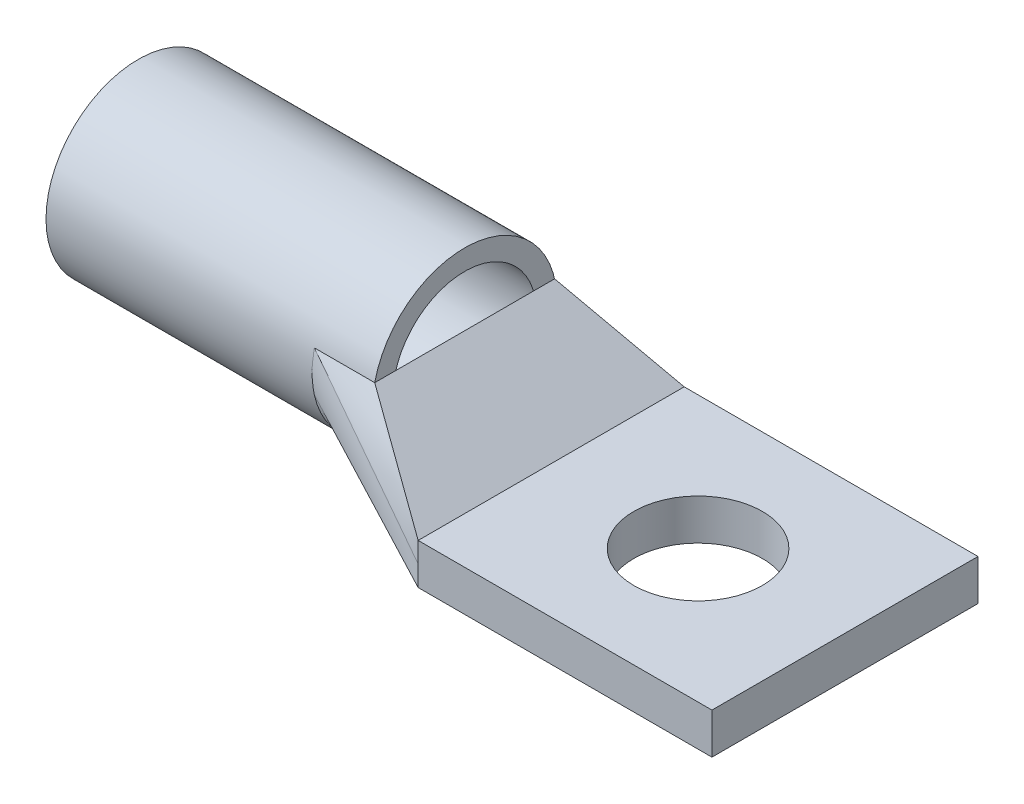
ISO-10303-21;
HEADER;
FILE_DESCRIPTION(('STEP AP214'),'2;1');
FILE_NAME('part.step','',(''),(''),'','','');
FILE_SCHEMA(('AUTOMOTIVE_DESIGN { 1 0 10303 214 1 1 1 1 }'));
ENDSEC;
DATA;
#1=APPLICATION_CONTEXT('core data for automotive mechanical design processes');
#2=APPLICATION_PROTOCOL_DEFINITION('international standard','automotive_design',2000,#1);
#3=PRODUCT_CONTEXT('',#1,'mechanical');
#4=PRODUCT('Part','Part','',(#3));
#5=PRODUCT_RELATED_PRODUCT_CATEGORY('part','',(#4));
#6=PRODUCT_DEFINITION_FORMATION('','',#4);
#7=PRODUCT_DEFINITION_CONTEXT('part definition',#1,'design');
#8=PRODUCT_DEFINITION('design','',#6,#7);
#9=PRODUCT_DEFINITION_SHAPE('','',#8);
#10=(LENGTH_UNIT() NAMED_UNIT(*) SI_UNIT(.MILLI.,.METRE.));
#11=(NAMED_UNIT(*) PLANE_ANGLE_UNIT() SI_UNIT($,.RADIAN.));
#12=(NAMED_UNIT(*) SI_UNIT($,.STERADIAN.) SOLID_ANGLE_UNIT());
#13=UNCERTAINTY_MEASURE_WITH_UNIT(LENGTH_MEASURE(1.E-05),#10,'distance_accuracy_value','');
#14=(GEOMETRIC_REPRESENTATION_CONTEXT(3) GLOBAL_UNCERTAINTY_ASSIGNED_CONTEXT((#13)) GLOBAL_UNIT_ASSIGNED_CONTEXT((#10,
#11,#12)) REPRESENTATION_CONTEXT('',''));
#15=CARTESIAN_POINT('',(0.,0.,0.));
#16=DIRECTION('',(0.,0.,1.));
#17=DIRECTION('',(1.,0.,0.));
#18=AXIS2_PLACEMENT_3D('',#15,#16,#17);
#19=CARTESIAN_POINT('',(-22.86,8.763,-6.9976884754896));
#20=CARTESIAN_POINT('',(-11.43,1.5875,-10.3505));
#21=CARTESIAN_POINT('',(-22.0768333333333,8.763,-6.9976884754896));
#22=CARTESIAN_POINT('',(-11.43,1.85208333333333,-10.3505));
#23=CARTESIAN_POINT('',(-21.2936666666666,8.763,-6.9976884754896));
#24=CARTESIAN_POINT('',(-11.43,2.11666666666666,-10.3505));
#25=CARTESIAN_POINT('',(-19.7273333333333,8.763,-6.9976884754896));
#26=CARTESIAN_POINT('',(-11.43,2.64583333333333,-10.3505));
#27=CARTESIAN_POINT('',(-18.9441666666666,8.763,-6.9976884754896));
#28=CARTESIAN_POINT('',(-11.43,2.91041666666667,-10.3505));
#29=CARTESIAN_POINT('',(-18.161,8.763,-6.9976884754896));
#30=CARTESIAN_POINT('',(-11.43,3.175,-10.3505));
#31=B_SPLINE_SURFACE_WITH_KNOTS('',3,1,((#19,#20),(#21,#22),(#23,#24),(#25,#26),(#27,#28),(#29,
#30)),.UNSPECIFIED.,.F.,.F.,.F.,(4,2,4),(2,2),(0.,0.5,1.),(0.,1.),.UNSPECIFIED.);
#32=DIRECTION('',(1.,0.,0.));
#33=VECTOR('',#32,1.);
#34=CARTESIAN_POINT('',(-20.5105,8.763,-6.9976884754896));
#35=LINE('',#34,#33);
#36=CARTESIAN_POINT('',(-22.86,8.763,-6.9976884754896));
#37=VERTEX_POINT('',#36);
#38=CARTESIAN_POINT('',(-18.161,8.763,-6.9976884754896));
#39=VERTEX_POINT('',#38);
#40=EDGE_CURVE('E107',#37,#39,#35,.T.);
#41=DIRECTION('',(0.718452409758832,-0.596451057158276,-0.357871864396327));
#42=VECTOR('',#41,1.);
#43=CARTESIAN_POINT('',(-14.7955,5.969,-8.6740942377448));
#44=LINE('',#43,#42);
#45=CARTESIAN_POINT('',(-11.43,3.175,-10.3505));
#46=VERTEX_POINT('',#45);
#47=EDGE_CURVE('E110',#39,#46,#44,.T.);
#48=DIRECTION('',(0.,-1.,0.));
#49=VECTOR('',#48,1.);
#50=CARTESIAN_POINT('',(-11.43,2.38125,-10.3505));
#51=LINE('',#50,#49);
#52=CARTESIAN_POINT('',(-11.43,1.5875,-10.3505));
#53=VERTEX_POINT('',#52);
#54=EDGE_CURVE('E126',#46,#53,#51,.T.);
#55=DIRECTION('',(-0.821953291698036,0.516004010899323,0.241107127647807));
#56=VECTOR('',#55,1.);
#57=CARTESIAN_POINT('',(-17.145,5.17525,-8.6740942377448));
#58=LINE('',#57,#56);
#59=EDGE_CURVE('E111',#53,#37,#58,.T.);
#60=ORIENTED_EDGE('',*,*,#40,.T.);
#61=ORIENTED_EDGE('',*,*,#47,.T.);
#62=ORIENTED_EDGE('',*,*,#54,.T.);
#63=ORIENTED_EDGE('',*,*,#59,.T.);
#64=EDGE_LOOP('',(#60,#61,#62,#63));
#65=FACE_BOUND('',#64,.T.);
#66=ADVANCED_FACE('F49',(#65),#31,.T.);
#67=CARTESIAN_POINT('',(-3.10313593256059,-3.73786828240253,0.));
#68=DIRECTION('',(0.638755375653495,0.769409884309892,0.));
#69=DIRECTION('',(-0.769409884309892,0.638755375653495,0.));
#70=AXIS2_PLACEMENT_3D('',#67,#68,#69);
#71=PLANE('',#70);
#72=DIRECTION('',(0.718452409758832,-0.596451057158275,0.357871864396328));
#73=VECTOR('',#72,1.);
#74=CARTESIAN_POINT('',(-18.161,8.76299999999999,6.9976884754896));
#75=LINE('',#74,#73);
#76=CARTESIAN_POINT('',(-18.161,8.76299999999999,6.9976884754896));
#77=VERTEX_POINT('',#76);
#78=CARTESIAN_POINT('',(-11.43,3.175,10.3505));
#79=VERTEX_POINT('',#78);
#80=EDGE_CURVE('E114',#77,#79,#75,.T.);
#81=ORIENTED_EDGE('',*,*,#80,.T.);
#82=DIRECTION('',(0.,0.,-1.));
#83=VECTOR('',#82,1.);
#84=CARTESIAN_POINT('',(-11.43,3.175,10.3505));
#85=LINE('',#84,#83);
#86=EDGE_CURVE('E121',#79,#46,#85,.T.);
#87=ORIENTED_EDGE('',*,*,#86,.T.);
#88=ORIENTED_EDGE('',*,*,#47,.F.);
#89=DIRECTION('',(0.,0.,-1.));
#90=VECTOR('',#89,1.);
#91=CARTESIAN_POINT('',(-18.161,8.76299999999999,6.9976884754896));
#92=LINE('',#91,#90);
#93=EDGE_CURVE('E116',#77,#39,#92,.T.);
#94=ORIENTED_EDGE('',*,*,#93,.F.);
#95=EDGE_LOOP('',(#81,#87,#88,#94));
#96=FACE_BOUND('',#95,.T.);
#97=ADVANCED_FACE('F123',(#96),#71,.T.);
#98=CARTESIAN_POINT('',(-22.86,5.588,-6.9976884754896));
#99=CARTESIAN_POINT('',(-11.43,0.,-10.3505));
#100=CARTESIAN_POINT('',(-22.86,6.10405372238124,-7.11476074687603));
#101=CARTESIAN_POINT('',(-11.43,0.264583333333334,-10.3505));
#102=CARTESIAN_POINT('',(-22.86,6.639694606142,-7.1755));
#103=CARTESIAN_POINT('',(-11.43,0.529166666666668,-10.3505));
#104=CARTESIAN_POINT('',(-22.86,7.71130539385799,-7.1755));
#105=CARTESIAN_POINT('',(-11.43,1.05833333333333,-10.3505));
#106=CARTESIAN_POINT('',(-22.86,8.24694627761876,-7.11476074687604));
#107=CARTESIAN_POINT('',(-11.43,1.32291666666667,-10.3505));
#108=CARTESIAN_POINT('',(-22.86,8.763,-6.9976884754896));
#109=CARTESIAN_POINT('',(-11.43,1.5875,-10.3505));
#110=B_SPLINE_SURFACE_WITH_KNOTS('',3,1,((#98,#99),(#100,#101),(#102,#103),(#104,#105),(#106,
#107),(#108,#109)),.UNSPECIFIED.,.F.,.F.,.F.,(4,2,4),(2,2),(0.,0.5,1.),(0.,1.),.UNSPECIFIED.);
#111=CARTESIAN_POINT('',(-22.86,5.588,-6.9976884754896));
#112=CARTESIAN_POINT('',(-22.86,6.10405372238124,-7.11476074687603));
#113=CARTESIAN_POINT('',(-22.86,6.639694606142,-7.1755));
#114=CARTESIAN_POINT('',(-22.86,7.71130539385799,-7.1755));
#115=CARTESIAN_POINT('',(-22.86,8.24694627761876,-7.11476074687604));
#116=CARTESIAN_POINT('',(-22.86,8.763,-6.9976884754896));
#117=B_SPLINE_CURVE_WITH_KNOTS('',3,(#111,#112,#113,#114,#115,#116),.UNSPECIFIED.,.F.,.F.,(4,2,
4),(0.,0.5,1.),.UNSPECIFIED.);
#118=CARTESIAN_POINT('',(-22.86,5.588,-6.9976884754896));
#119=VERTEX_POINT('',#118);
#120=EDGE_CURVE('E135',#119,#37,#117,.T.);
#121=DIRECTION('',(0.,-1.,0.));
#122=VECTOR('',#121,1.);
#123=CARTESIAN_POINT('',(-11.43,0.793750000000001,-10.3505));
#124=LINE('',#123,#122);
#125=CARTESIAN_POINT('',(-11.43,0.,-10.3505));
#126=VERTEX_POINT('',#125);
#127=EDGE_CURVE('E67',#53,#126,#124,.T.);
#128=DIRECTION('',(0.868725674821973,-0.424710329912965,-0.254827073856622));
#129=VECTOR('',#128,1.);
#130=CARTESIAN_POINT('',(-17.145,2.794,-8.6740942377448));
#131=LINE('',#130,#129);
#132=EDGE_CURVE('E59',#119,#126,#131,.T.);
#133=ORIENTED_EDGE('',*,*,#120,.T.);
#134=ORIENTED_EDGE('',*,*,#59,.F.);
#135=ORIENTED_EDGE('',*,*,#127,.T.);
#136=ORIENTED_EDGE('',*,*,#132,.F.);
#137=EDGE_LOOP('',(#133,#134,#135,#136));
#138=FACE_BOUND('',#137,.T.);
#139=ADVANCED_FACE('F185',(#138),#110,.T.);
#140=CARTESIAN_POINT('',(-18.161,8.76299999999999,6.9976884754896));
#141=CARTESIAN_POINT('',(-11.43,3.175,10.3505));
#142=CARTESIAN_POINT('',(-18.9441666666667,8.76299999999999,6.9976884754896));
#143=CARTESIAN_POINT('',(-11.43,2.91041666666667,10.3505));
#144=CARTESIAN_POINT('',(-19.7273333333334,8.76299999999999,6.9976884754896));
#145=CARTESIAN_POINT('',(-11.43,2.64583333333333,10.3505));
#146=CARTESIAN_POINT('',(-21.2936666666667,8.763,6.9976884754896));
#147=CARTESIAN_POINT('',(-11.43,2.11666666666667,10.3505));
#148=CARTESIAN_POINT('',(-22.0768333333334,8.763,6.9976884754896));
#149=CARTESIAN_POINT('',(-11.43,1.85208333333333,10.3505));
#150=CARTESIAN_POINT('',(-22.86,8.763,6.9976884754896));
#151=CARTESIAN_POINT('',(-11.43,1.5875,10.3505));
#152=B_SPLINE_SURFACE_WITH_KNOTS('',3,1,((#140,#141),(#142,#143),(#144,#145),(#146,#147),(#148,
#149),(#150,#151)),.UNSPECIFIED.,.F.,.F.,.F.,(4,2,4),(2,2),(0.,0.5,1.),(0.,1.),.UNSPECIFIED.);
#153=DIRECTION('',(-1.,0.,0.));
#154=VECTOR('',#153,1.);
#155=CARTESIAN_POINT('',(-20.5105000000001,8.763,6.9976884754896));
#156=LINE('',#155,#154);
#157=CARTESIAN_POINT('',(-22.86,8.763,6.9976884754896));
#158=VERTEX_POINT('',#157);
#159=EDGE_CURVE('E146',#77,#158,#156,.T.);
#160=DIRECTION('',(0.821953291698036,-0.516004010899322,0.241107127647807));
#161=VECTOR('',#160,1.);
#162=CARTESIAN_POINT('',(-17.145,5.17525,8.6740942377448));
#163=LINE('',#162,#161);
#164=CARTESIAN_POINT('',(-11.43,1.5875,10.3505));
#165=VERTEX_POINT('',#164);
#166=EDGE_CURVE('E150',#158,#165,#163,.T.);
#167=DIRECTION('',(0.,1.,0.));
#168=VECTOR('',#167,1.);
#169=CARTESIAN_POINT('',(-11.43,2.38125,10.3505));
#170=LINE('',#169,#168);
#171=EDGE_CURVE('E140',#165,#79,#170,.T.);
#172=ORIENTED_EDGE('',*,*,#159,.T.);
#173=ORIENTED_EDGE('',*,*,#166,.T.);
#174=ORIENTED_EDGE('',*,*,#171,.T.);
#175=ORIENTED_EDGE('',*,*,#80,.F.);
#176=EDGE_LOOP('',(#172,#173,#174,#175));
#177=FACE_BOUND('',#176,.T.);
#178=ADVANCED_FACE('F182',(#177),#152,.T.);
#179=CARTESIAN_POINT('',(-22.86,8.76299999999999,6.9976884754896));
#180=CARTESIAN_POINT('',(-11.43,1.5875,10.3505));
#181=CARTESIAN_POINT('',(-22.86,8.24694627761875,7.11476074687603));
#182=CARTESIAN_POINT('',(-11.43,1.32291666666667,10.3505));
#183=CARTESIAN_POINT('',(-22.86,7.71130539385799,7.1755));
#184=CARTESIAN_POINT('',(-11.43,1.05833333333334,10.3505));
#185=CARTESIAN_POINT('',(-22.86,6.639694606142,7.1755));
#186=CARTESIAN_POINT('',(-11.43,0.52916666666667,10.3505));
#187=CARTESIAN_POINT('',(-22.86,6.10405372238123,7.11476074687603));
#188=CARTESIAN_POINT('',(-11.43,0.264583333333336,10.3505));
#189=CARTESIAN_POINT('',(-22.86,5.588,6.9976884754896));
#190=CARTESIAN_POINT('',(-11.43,0.,10.3505));
#191=B_SPLINE_SURFACE_WITH_KNOTS('',3,1,((#179,#180),(#181,#182),(#183,#184),(#185,#186),(#187,
#188),(#189,#190)),.UNSPECIFIED.,.F.,.F.,.F.,(4,2,4),(2,2),(0.,0.5,1.),(0.,1.),.UNSPECIFIED.);
#192=CARTESIAN_POINT('',(-22.86,8.76299999999999,6.9976884754896));
#193=CARTESIAN_POINT('',(-22.86,8.24694627761875,7.11476074687603));
#194=CARTESIAN_POINT('',(-22.86,7.71130539385799,7.1755));
#195=CARTESIAN_POINT('',(-22.86,6.639694606142,7.1755));
#196=CARTESIAN_POINT('',(-22.86,6.10405372238123,7.11476074687603));
#197=CARTESIAN_POINT('',(-22.86,5.588,6.9976884754896));
#198=B_SPLINE_CURVE_WITH_KNOTS('',3,(#192,#193,#194,#195,#196,#197),.UNSPECIFIED.,.F.,.F.,(4,2,
4),(0.,0.5,1.),.UNSPECIFIED.);
#199=CARTESIAN_POINT('',(-22.86,5.588,6.9976884754896));
#200=VERTEX_POINT('',#199);
#201=EDGE_CURVE('E155',#158,#200,#198,.T.);
#202=DIRECTION('',(0.868725674821973,-0.424710329912965,0.254827073856622));
#203=VECTOR('',#202,1.);
#204=CARTESIAN_POINT('',(-17.145,2.794,8.6740942377448));
#205=LINE('',#204,#203);
#206=CARTESIAN_POINT('',(-11.43,0.,10.3505));
#207=VERTEX_POINT('',#206);
#208=EDGE_CURVE('E160',#200,#207,#205,.T.);
#209=DIRECTION('',(0.,1.,0.));
#210=VECTOR('',#209,1.);
#211=CARTESIAN_POINT('',(-11.43,0.793750000000003,10.3505));
#212=LINE('',#211,#210);
#213=EDGE_CURVE('E149',#207,#165,#212,.T.);
#214=ORIENTED_EDGE('',*,*,#201,.T.);
#215=ORIENTED_EDGE('',*,*,#208,.T.);
#216=ORIENTED_EDGE('',*,*,#213,.T.);
#217=ORIENTED_EDGE('',*,*,#166,.F.);
#218=EDGE_LOOP('',(#214,#215,#216,#217));
#219=FACE_BOUND('',#218,.T.);
#220=ADVANCED_FACE('F177',(#219),#191,.T.);
#221=CARTESIAN_POINT('',(-22.86,5.588,6.9976884754896));
#222=CARTESIAN_POINT('',(-11.43,0.,10.3505));
#223=CARTESIAN_POINT('',(-22.86,5.01930973451327,6.86867504489429));
#224=CARTESIAN_POINT('',(-11.43,0.,9.48795833333333));
#225=CARTESIAN_POINT('',(-22.86,4.40832104533333,6.65766923742368));
#226=CARTESIAN_POINT('',(-11.43,0.,8.62541666666666));
#227=CARTESIAN_POINT('',(-22.86,3.16900695466666,5.99415152626152));
#228=CARTESIAN_POINT('',(-11.43,0.,6.90033333333333));
#229=CARTESIAN_POINT('',(-22.86,2.54057546875,5.53929001535045));
#230=CARTESIAN_POINT('',(-11.43,0.,6.03779166666667));
#231=CARTESIAN_POINT('',(-22.86,1.689606015625,4.64353122104657));
#232=CARTESIAN_POINT('',(-11.43,0.,4.74397916666667));
#233=CARTESIAN_POINT('',(-22.86,1.42185277662038,4.30991490275199));
#234=CARTESIAN_POINT('',(-11.43,0.,4.31270833333333));
#235=CARTESIAN_POINT('',(-22.86,0.940157198441964,3.57775390253803));
#236=CARTESIAN_POINT('',(-11.43,0.,3.45016666666667));
#237=CARTESIAN_POINT('',(-22.86,0.726357233910815,3.17918551698283));
#238=CARTESIAN_POINT('',(-11.43,0.,3.01889583333333));
#239=CARTESIAN_POINT('',(-22.86,0.373719421141448,2.33118938009259));
#240=CARTESIAN_POINT('',(-11.43,0.,2.15635416666667));
#241=CARTESIAN_POINT('',(-22.86,0.235034455549075,1.88182551258604));
#242=CARTESIAN_POINT('',(-11.43,0.,1.72508333333333));
#243=CARTESIAN_POINT('',(-22.86,0.0481242888455429,0.95490560034785));
#244=CARTESIAN_POINT('',(-11.43,0.,0.862541666666667));
#245=CARTESIAN_POINT('',(-22.86,0.,0.477499273991737));
#246=CARTESIAN_POINT('',(-11.43,0.,0.431270833333334));
#247=CARTESIAN_POINT('',(-22.86,0.,-0.477499273991746));
#248=CARTESIAN_POINT('',(-11.43,0.,-0.431270833333332));
#249=CARTESIAN_POINT('',(-22.86,0.0481242888455435,-0.954905600347859));
#250=CARTESIAN_POINT('',(-11.43,0.,-0.862541666666665));
#251=CARTESIAN_POINT('',(-22.86,0.235034455549077,-1.88182551258605));
#252=CARTESIAN_POINT('',(-11.43,0.,-1.72508333333333));
#253=CARTESIAN_POINT('',(-22.86,0.37371942114145,-2.3311893800926));
#254=CARTESIAN_POINT('',(-11.43,0.,-2.15635416666667));
#255=CARTESIAN_POINT('',(-22.86,0.726357233910817,-3.17918551698284));
#256=CARTESIAN_POINT('',(-11.43,0.,-3.01889583333333));
#257=CARTESIAN_POINT('',(-22.86,0.940157198441969,-3.57775390253804));
#258=CARTESIAN_POINT('',(-11.43,0.,-3.45016666666666));
#259=CARTESIAN_POINT('',(-22.86,1.42185277662038,-4.30991490275199));
#260=CARTESIAN_POINT('',(-11.43,0.,-4.31270833333333));
#261=CARTESIAN_POINT('',(-22.86,1.689606015625,-4.64353122104658));
#262=CARTESIAN_POINT('',(-11.43,0.,-4.74397916666666));
#263=CARTESIAN_POINT('',(-22.86,2.54057546875,-5.53929001535046));
#264=CARTESIAN_POINT('',(-11.43,0.,-6.03779166666666));
#265=CARTESIAN_POINT('',(-22.86,3.16900695466667,-5.99415152626153));
#266=CARTESIAN_POINT('',(-11.43,0.,-6.90033333333333));
#267=CARTESIAN_POINT('',(-22.86,4.40832104533333,-6.65766923742368));
#268=CARTESIAN_POINT('',(-11.43,0.,-8.62541666666666));
#269=CARTESIAN_POINT('',(-22.86,5.01930973451328,-6.8686750448943));
#270=CARTESIAN_POINT('',(-11.43,0.,-9.48795833333333));
#271=CARTESIAN_POINT('',(-22.86,5.588,-6.9976884754896));
#272=CARTESIAN_POINT('',(-11.43,0.,-10.3505));
#273=B_SPLINE_SURFACE_WITH_KNOTS('',3,1,((#221,#222),(#223,#224),(#225,#226),(#227,#228),(#229,
#230),(#231,#232),(#233,#234),(#235,#236),(#237,#238),(#239,#240),(#241,#242),(#243,#244),(#245,
#246),(#247,#248),(#249,#250),(#251,#252),(#253,#254),(#255,#256),(#257,#258),(#259,#260),(#261,
#262),(#263,#264),(#265,#266),(#267,#268),(#269,#270),(#271,#272)),.UNSPECIFIED.,.F.,.F.,.F.,(4,
2,2,2,2,2,2,2,2,2,2,2,4),(2,2),(0.,0.125,0.25,0.3125,0.375,0.4375,0.5,0.5625,0.625,0.6875,0.75,
0.875,1.),(0.,1.),.UNSPECIFIED.);
#274=CARTESIAN_POINT('',(-22.86,5.588,6.9976884754896));
#275=CARTESIAN_POINT('',(-22.86,5.01930973451327,6.86867504489429));
#276=CARTESIAN_POINT('',(-22.86,4.40832104533333,6.65766923742368));
#277=CARTESIAN_POINT('',(-22.86,3.16900695466666,5.99415152626152));
#278=CARTESIAN_POINT('',(-22.86,2.54057546875,5.53929001535045));
#279=CARTESIAN_POINT('',(-22.86,1.689606015625,4.64353122104657));
#280=CARTESIAN_POINT('',(-22.86,1.42185277662038,4.30991490275199));
#281=CARTESIAN_POINT('',(-22.86,0.940157198441964,3.57775390253803));
#282=CARTESIAN_POINT('',(-22.86,0.726357233910815,3.17918551698283));
#283=CARTESIAN_POINT('',(-22.86,0.373719421141448,2.33118938009259));
#284=CARTESIAN_POINT('',(-22.86,0.235034455549075,1.88182551258604));
#285=CARTESIAN_POINT('',(-22.86,0.0481242888455429,0.95490560034785));
#286=CARTESIAN_POINT('',(-22.86,0.,0.477499273991737));
#287=CARTESIAN_POINT('',(-22.86,0.,-0.477499273991746));
#288=CARTESIAN_POINT('',(-22.86,0.0481242888455435,-0.954905600347859));
#289=CARTESIAN_POINT('',(-22.86,0.235034455549077,-1.88182551258605));
#290=CARTESIAN_POINT('',(-22.86,0.37371942114145,-2.3311893800926));
#291=CARTESIAN_POINT('',(-22.86,0.726357233910817,-3.17918551698284));
#292=CARTESIAN_POINT('',(-22.86,0.940157198441969,-3.57775390253804));
#293=CARTESIAN_POINT('',(-22.86,1.42185277662038,-4.30991490275199));
#294=CARTESIAN_POINT('',(-22.86,1.689606015625,-4.64353122104658));
#295=CARTESIAN_POINT('',(-22.86,2.54057546875,-5.53929001535046));
#296=CARTESIAN_POINT('',(-22.86,3.16900695466667,-5.99415152626153));
#297=CARTESIAN_POINT('',(-22.86,4.40832104533333,-6.65766923742368));
#298=CARTESIAN_POINT('',(-22.86,5.01930973451328,-6.8686750448943));
#299=CARTESIAN_POINT('',(-22.86,5.588,-6.9976884754896));
#300=B_SPLINE_CURVE_WITH_KNOTS('',3,(#274,#275,#276,#277,#278,#279,#280,#281,#282,#283,#284,
#285,#286,#287,#288,#289,#290,#291,#292,#293,#294,#295,#296,#297,#298,#299),.UNSPECIFIED.,.F.,
.F.,(4,2,2,2,2,2,2,2,2,2,2,2,4),(0.,0.125,0.25,0.3125,0.375,0.4375,0.5,0.5625,0.625,0.6875,0.75,
0.875,1.),.UNSPECIFIED.);
#301=EDGE_CURVE('E13',#200,#119,#300,.T.);
#302=DIRECTION('',(0.,0.,1.));
#303=VECTOR('',#302,1.);
#304=CARTESIAN_POINT('',(-11.43,0.,0.));
#305=LINE('',#304,#303);
#306=EDGE_CURVE('E54',#126,#207,#305,.T.);
#307=ORIENTED_EDGE('',*,*,#301,.T.);
#308=ORIENTED_EDGE('',*,*,#132,.T.);
#309=ORIENTED_EDGE('',*,*,#306,.T.);
#310=ORIENTED_EDGE('',*,*,#208,.F.);
#311=EDGE_LOOP('',(#307,#308,#309,#310));
#312=FACE_BOUND('',#311,.T.);
#313=ADVANCED_FACE('F50',(#312),#273,.T.);
#314=OPEN_SHELL('',(#66,#97,#139,#178,#220,#313));
#315=SHELL_BASED_SURFACE_MODEL('B2',(#314));
#316=CARTESIAN_POINT('',(2.13437883361629,7.1755,0.));
#317=DIRECTION('',(-1.,0.,0.));
#318=DIRECTION('',(0.,0.,1.));
#319=AXIS2_PLACEMENT_3D('',#316,#317,#318);
#320=CYLINDRICAL_SURFACE('',#319,7.1755);
#321=CARTESIAN_POINT('',(-18.161,7.1755,0.));
#322=DIRECTION('',(-1.,0.,0.));
#323=DIRECTION('',(0.,0.,1.));
#324=AXIS2_PLACEMENT_3D('',#321,#322,#323);
#325=CIRCLE('',#324,7.1755);
#326=CARTESIAN_POINT('',(-18.161,7.1755,7.1755));
#327=VERTEX_POINT('',#326);
#328=EDGE_CURVE('E303',#327,#327,#325,.F.);
#329=ORIENTED_EDGE('',*,*,#328,.F.);
#330=EDGE_LOOP('',(#329));
#331=FACE_BOUND('',#330,.T.);
#332=CARTESIAN_POINT('',(-43.561,7.1755,0.));
#333=DIRECTION('',(-1.,0.,0.));
#334=DIRECTION('',(0.,0.,1.));
#335=AXIS2_PLACEMENT_3D('',#332,#333,#334);
#336=CIRCLE('',#335,7.1755);
#337=CARTESIAN_POINT('',(-43.561,7.1755,7.1755));
#338=VERTEX_POINT('',#337);
#339=EDGE_CURVE('E307',#338,#338,#336,.T.);
#340=ORIENTED_EDGE('',*,*,#339,.F.);
#341=EDGE_LOOP('',(#340));
#342=FACE_BOUND('',#341,.T.);
#343=ADVANCED_FACE('F297',(#331,#342),#320,.T.);
#344=CARTESIAN_POINT('',(-43.561,7.1755,0.));
#345=DIRECTION('',(-1.,0.,0.));
#346=DIRECTION('',(0.,0.,1.));
#347=AXIS2_PLACEMENT_3D('',#344,#345,#346);
#348=PLANE('',#347);
#349=CARTESIAN_POINT('',(-43.561,7.1755,0.));
#350=DIRECTION('',(-1.,0.,0.));
#351=DIRECTION('',(0.,0.,1.));
#352=AXIS2_PLACEMENT_3D('',#349,#350,#351);
#353=CIRCLE('',#352,5.588);
#354=CARTESIAN_POINT('',(-43.561,7.1755,5.588));
#355=VERTEX_POINT('',#354);
#356=EDGE_CURVE('E312',#355,#355,#353,.T.);
#357=ORIENTED_EDGE('',*,*,#356,.F.);
#358=EDGE_LOOP('',(#357));
#359=FACE_BOUND('',#358,.T.);
#360=ORIENTED_EDGE('',*,*,#339,.T.);
#361=EDGE_LOOP('',(#360));
#362=FACE_BOUND('',#361,.T.);
#363=ADVANCED_FACE('F319',(#359,#362),#348,.T.);
#364=CARTESIAN_POINT('',(2.13437883361629,7.1755,0.));
#365=DIRECTION('',(-1.,0.,0.));
#366=DIRECTION('',(0.,0.,1.));
#367=AXIS2_PLACEMENT_3D('',#364,#365,#366);
#368=CYLINDRICAL_SURFACE('',#367,5.588);
#369=CARTESIAN_POINT('',(-18.161,7.1755,0.));
#370=DIRECTION('',(-1.,0.,0.));
#371=DIRECTION('',(0.,0.,1.));
#372=AXIS2_PLACEMENT_3D('',#369,#370,#371);
#373=CIRCLE('',#372,5.588);
#374=CARTESIAN_POINT('',(-18.161,7.1755,5.588));
#375=VERTEX_POINT('',#374);
#376=EDGE_CURVE('E48',#375,#375,#373,.F.);
#377=ORIENTED_EDGE('',*,*,#376,.T.);
#378=EDGE_LOOP('',(#377));
#379=FACE_BOUND('',#378,.T.);
#380=ORIENTED_EDGE('',*,*,#356,.T.);
#381=EDGE_LOOP('',(#380));
#382=FACE_BOUND('',#381,.T.);
#383=ADVANCED_FACE('F317',(#379,#382),#368,.F.);
#384=CARTESIAN_POINT('',(-18.161,0.,0.));
#385=DIRECTION('',(-1.,0.,0.));
#386=DIRECTION('',(0.,0.,1.));
#387=AXIS2_PLACEMENT_3D('',#384,#385,#386);
#388=PLANE('',#387);
#389=ORIENTED_EDGE('',*,*,#328,.T.);
#390=EDGE_LOOP('',(#389));
#391=FACE_BOUND('',#390,.T.);
#392=ORIENTED_EDGE('',*,*,#376,.F.);
#393=EDGE_LOOP('',(#392));
#394=FACE_BOUND('',#393,.T.);
#395=ADVANCED_FACE('F338',(#391,#394),#388,.F.);
#396=CLOSED_SHELL('',(#343,#363,#383,#395));
#397=MANIFOLD_SOLID_BREP('B7',#396);
#398=CARTESIAN_POINT('',(0.,3.175,0.));
#399=DIRECTION('',(0.,-1.,0.));
#400=DIRECTION('',(0.,0.,-1.));
#401=AXIS2_PLACEMENT_3D('',#398,#399,#400);
#402=PLANE('',#401);
#403=DIRECTION('',(0.,0.,-1.));
#404=VECTOR('',#403,1.);
#405=CARTESIAN_POINT('',(11.43,3.175,-10.3505));
#406=LINE('',#405,#404);
#407=CARTESIAN_POINT('',(11.43,3.175,10.3505));
#408=VERTEX_POINT('',#407);
#409=CARTESIAN_POINT('',(11.43,3.175,-10.3505));
#410=VERTEX_POINT('',#409);
#411=EDGE_CURVE('E410',#408,#410,#406,.T.);
#412=ORIENTED_EDGE('',*,*,#411,.T.);
#413=DIRECTION('',(-1.,0.,0.));
#414=VECTOR('',#413,1.);
#415=CARTESIAN_POINT('',(11.43,3.175,-10.3505));
#416=LINE('',#415,#414);
#417=CARTESIAN_POINT('',(-11.43,3.175,-10.3505));
#418=VERTEX_POINT('',#417);
#419=EDGE_CURVE('E405',#410,#418,#416,.T.);
#420=ORIENTED_EDGE('',*,*,#419,.T.);
#421=DIRECTION('',(0.,0.,1.));
#422=VECTOR('',#421,1.);
#423=CARTESIAN_POINT('',(-11.43,3.175,-10.3505));
#424=LINE('',#423,#422);
#425=CARTESIAN_POINT('',(-11.43,3.175,10.3505));
#426=VERTEX_POINT('',#425);
#427=EDGE_CURVE('E408',#418,#426,#424,.T.);
#428=ORIENTED_EDGE('',*,*,#427,.T.);
#429=DIRECTION('',(1.,0.,0.));
#430=VECTOR('',#429,1.);
#431=CARTESIAN_POINT('',(11.43,3.175,10.3505));
#432=LINE('',#431,#430);
#433=EDGE_CURVE('E375',#426,#408,#432,.T.);
#434=ORIENTED_EDGE('',*,*,#433,.T.);
#435=EDGE_LOOP('',(#412,#420,#428,#434));
#436=FACE_BOUND('',#435,.T.);
#437=CARTESIAN_POINT('',(0.,3.175,0.));
#438=DIRECTION('',(0.,1.,0.));
#439=DIRECTION('',(0.,0.,1.));
#440=AXIS2_PLACEMENT_3D('',#437,#438,#439);
#441=CIRCLE('',#440,5.);
#442=CARTESIAN_POINT('',(0.,3.175,5.));
#443=VERTEX_POINT('',#442);
#444=EDGE_CURVE('E425',#443,#443,#441,.T.);
#445=ORIENTED_EDGE('',*,*,#444,.F.);
#446=EDGE_LOOP('',(#445));
#447=FACE_BOUND('',#446,.T.);
#448=ADVANCED_FACE('F358',(#436,#447),#402,.F.);
#449=CARTESIAN_POINT('',(0.,0.,0.));
#450=DIRECTION('',(0.,-1.,0.));
#451=DIRECTION('',(0.,0.,-1.));
#452=AXIS2_PLACEMENT_3D('',#449,#450,#451);
#453=PLANE('',#452);
#454=DIRECTION('',(0.,0.,-1.));
#455=VECTOR('',#454,1.);
#456=CARTESIAN_POINT('',(11.43,0.,-10.3505));
#457=LINE('',#456,#455);
#458=CARTESIAN_POINT('',(11.43,0.,10.3505));
#459=VERTEX_POINT('',#458);
#460=CARTESIAN_POINT('',(11.43,0.,-10.3505));
#461=VERTEX_POINT('',#460);
#462=EDGE_CURVE('E422',#459,#461,#457,.T.);
#463=ORIENTED_EDGE('',*,*,#462,.F.);
#464=DIRECTION('',(1.,0.,0.));
#465=VECTOR('',#464,1.);
#466=CARTESIAN_POINT('',(11.43,0.,10.3505));
#467=LINE('',#466,#465);
#468=CARTESIAN_POINT('',(-11.43,0.,10.3505));
#469=VERTEX_POINT('',#468);
#470=EDGE_CURVE('E398',#469,#459,#467,.T.);
#471=ORIENTED_EDGE('',*,*,#470,.F.);
#472=DIRECTION('',(0.,0.,1.));
#473=VECTOR('',#472,1.);
#474=CARTESIAN_POINT('',(-11.43,0.,-10.3505));
#475=LINE('',#474,#473);
#476=CARTESIAN_POINT('',(-11.43,0.,-10.3505));
#477=VERTEX_POINT('',#476);
#478=EDGE_CURVE('E392',#477,#469,#475,.T.);
#479=ORIENTED_EDGE('',*,*,#478,.F.);
#480=DIRECTION('',(-1.,0.,0.));
#481=VECTOR('',#480,1.);
#482=CARTESIAN_POINT('',(11.43,0.,-10.3505));
#483=LINE('',#482,#481);
#484=EDGE_CURVE('E414',#461,#477,#483,.T.);
#485=ORIENTED_EDGE('',*,*,#484,.F.);
#486=EDGE_LOOP('',(#463,#471,#479,#485));
#487=FACE_BOUND('',#486,.T.);
#488=CARTESIAN_POINT('',(0.,0.,0.));
#489=DIRECTION('',(0.,1.,0.));
#490=DIRECTION('',(0.,0.,1.));
#491=AXIS2_PLACEMENT_3D('',#488,#489,#490);
#492=CIRCLE('',#491,5.);
#493=CARTESIAN_POINT('',(0.,0.,5.));
#494=VERTEX_POINT('',#493);
#495=EDGE_CURVE('E437',#494,#494,#492,.T.);
#496=ORIENTED_EDGE('',*,*,#495,.T.);
#497=EDGE_LOOP('',(#496));
#498=FACE_BOUND('',#497,.T.);
#499=ADVANCED_FACE('F433',(#487,#498),#453,.T.);
#500=CARTESIAN_POINT('',(11.43,3.175,-10.3505));
#501=DIRECTION('',(-1.,0.,0.));
#502=DIRECTION('',(0.,0.,1.));
#503=AXIS2_PLACEMENT_3D('',#500,#501,#502);
#504=PLANE('',#503);
#505=ORIENTED_EDGE('',*,*,#462,.T.);
#506=DIRECTION('',(0.,-1.,0.));
#507=VECTOR('',#506,1.);
#508=CARTESIAN_POINT('',(11.43,3.175,-10.3505));
#509=LINE('',#508,#507);
#510=EDGE_CURVE('E295',#410,#461,#509,.T.);
#511=ORIENTED_EDGE('',*,*,#510,.F.);
#512=ORIENTED_EDGE('',*,*,#411,.F.);
#513=DIRECTION('',(0.,-1.,0.));
#514=VECTOR('',#513,1.);
#515=CARTESIAN_POINT('',(11.43,3.175,10.3505));
#516=LINE('',#515,#514);
#517=EDGE_CURVE('E418',#408,#459,#516,.T.);
#518=ORIENTED_EDGE('',*,*,#517,.T.);
#519=EDGE_LOOP('',(#505,#511,#512,#518));
#520=FACE_BOUND('',#519,.T.);
#521=ADVANCED_FACE('F360',(#520),#504,.F.);
#522=CARTESIAN_POINT('',(11.43,3.175,-10.3505));
#523=DIRECTION('',(0.,0.,1.));
#524=DIRECTION('',(1.,0.,0.));
#525=AXIS2_PLACEMENT_3D('',#522,#523,#524);
#526=PLANE('',#525);
#527=ORIENTED_EDGE('',*,*,#484,.T.);
#528=DIRECTION('',(0.,-1.,0.));
#529=VECTOR('',#528,1.);
#530=CARTESIAN_POINT('',(-11.43,3.175,-10.3505));
#531=LINE('',#530,#529);
#532=EDGE_CURVE('E367',#418,#477,#531,.T.);
#533=ORIENTED_EDGE('',*,*,#532,.F.);
#534=ORIENTED_EDGE('',*,*,#419,.F.);
#535=ORIENTED_EDGE('',*,*,#510,.T.);
#536=EDGE_LOOP('',(#527,#533,#534,#535));
#537=FACE_BOUND('',#536,.T.);
#538=ADVANCED_FACE('F413',(#537),#526,.F.);
#539=CARTESIAN_POINT('',(-11.43,3.175,-10.3505));
#540=DIRECTION('',(1.,0.,0.));
#541=DIRECTION('',(0.,0.,-1.));
#542=AXIS2_PLACEMENT_3D('',#539,#540,#541);
#543=PLANE('',#542);
#544=ORIENTED_EDGE('',*,*,#478,.T.);
#545=DIRECTION('',(0.,-1.,0.));
#546=VECTOR('',#545,1.);
#547=CARTESIAN_POINT('',(-11.43,3.175,10.3505));
#548=LINE('',#547,#546);
#549=EDGE_CURVE('E415',#426,#469,#548,.T.);
#550=ORIENTED_EDGE('',*,*,#549,.F.);
#551=ORIENTED_EDGE('',*,*,#427,.F.);
#552=ORIENTED_EDGE('',*,*,#532,.T.);
#553=EDGE_LOOP('',(#544,#550,#551,#552));
#554=FACE_BOUND('',#553,.T.);
#555=ADVANCED_FACE('F416',(#554),#543,.F.);
#556=CARTESIAN_POINT('',(11.43,3.175,10.3505));
#557=DIRECTION('',(0.,0.,-1.));
#558=DIRECTION('',(-1.,0.,0.));
#559=AXIS2_PLACEMENT_3D('',#556,#557,#558);
#560=PLANE('',#559);
#561=ORIENTED_EDGE('',*,*,#470,.T.);
#562=ORIENTED_EDGE('',*,*,#517,.F.);
#563=ORIENTED_EDGE('',*,*,#433,.F.);
#564=ORIENTED_EDGE('',*,*,#549,.T.);
#565=EDGE_LOOP('',(#561,#562,#563,#564));
#566=FACE_BOUND('',#565,.T.);
#567=ADVANCED_FACE('F430',(#566),#560,.F.);
#568=CARTESIAN_POINT('',(0.,3.175,0.));
#569=DIRECTION('',(0.,-1.,0.));
#570=DIRECTION('',(0.,0.,-1.));
#571=AXIS2_PLACEMENT_3D('',#568,#569,#570);
#572=CYLINDRICAL_SURFACE('',#571,5.);
#573=ORIENTED_EDGE('',*,*,#444,.T.);
#574=EDGE_LOOP('',(#573));
#575=FACE_BOUND('',#574,.T.);
#576=ORIENTED_EDGE('',*,*,#495,.F.);
#577=EDGE_LOOP('',(#576));
#578=FACE_BOUND('',#577,.T.);
#579=ADVANCED_FACE('F443',(#575,#578),#572,.F.);
#580=CLOSED_SHELL('',(#448,#499,#521,#538,#555,#567,#579));
#581=MANIFOLD_SOLID_BREP('B43',#580);
#582=ADVANCED_BREP_SHAPE_REPRESENTATION('',(#18,#397,#581),#14);
#583=MANIFOLD_SURFACE_SHAPE_REPRESENTATION('',(#18,#315),#14);
#584=SHAPE_REPRESENTATION('',(#18),#14);
#585=SHAPE_DEFINITION_REPRESENTATION(#9,#584);
#586=SHAPE_REPRESENTATION_RELATIONSHIP('','',#584,#582);
#587=SHAPE_REPRESENTATION_RELATIONSHIP('','',#584,#583);
ENDSEC;
END-ISO-10303-21;
